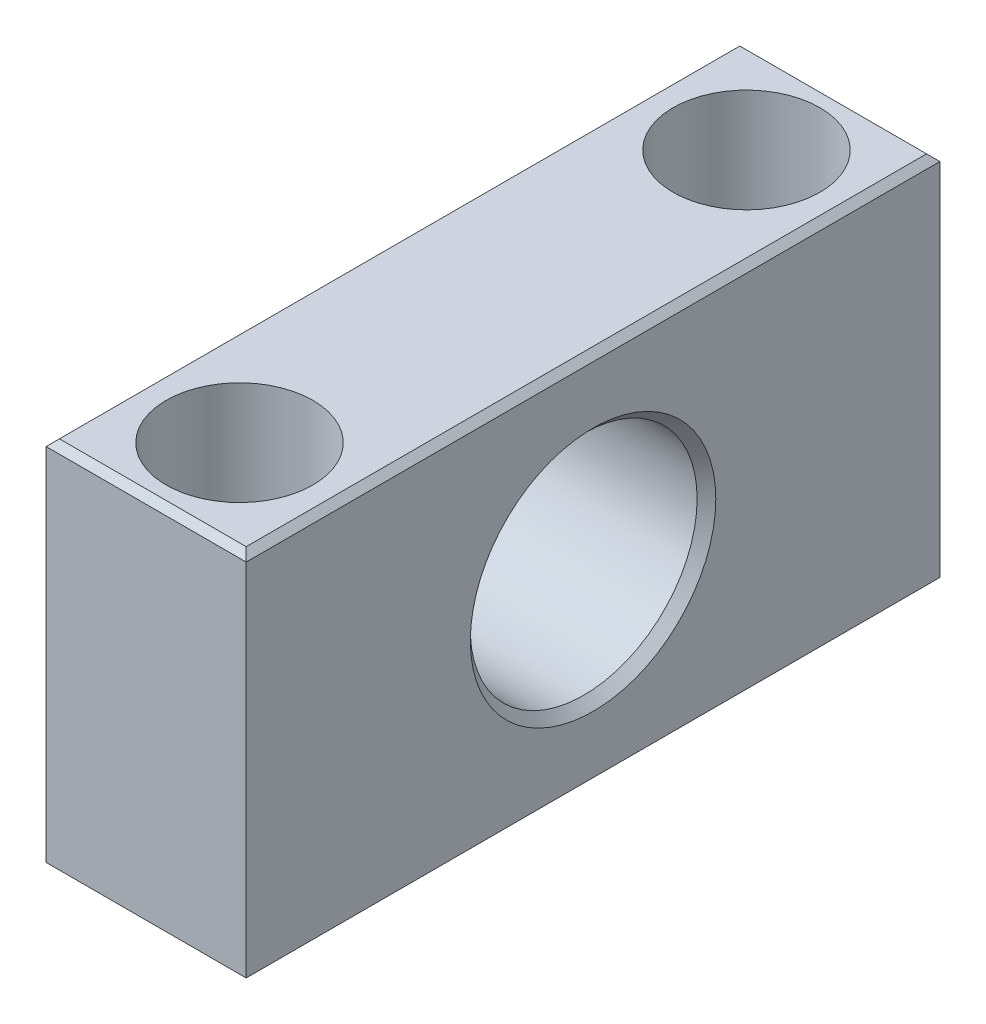
ISO-10303-21;
HEADER;
FILE_DESCRIPTION(('STEP AP214'),'2;1');
FILE_NAME('part.step','',(''),(''),'','','');
FILE_SCHEMA(('AUTOMOTIVE_DESIGN { 1 0 10303 214 1 1 1 1 }'));
ENDSEC;
DATA;
#1=APPLICATION_CONTEXT('core data for automotive mechanical design processes');
#2=APPLICATION_PROTOCOL_DEFINITION('international standard','automotive_design',2000,#1);
#3=PRODUCT_CONTEXT('',#1,'mechanical');
#4=PRODUCT('Part','Part','',(#3));
#5=PRODUCT_RELATED_PRODUCT_CATEGORY('part','',(#4));
#6=PRODUCT_DEFINITION_FORMATION('','',#4);
#7=PRODUCT_DEFINITION_CONTEXT('part definition',#1,'design');
#8=PRODUCT_DEFINITION('design','',#6,#7);
#9=PRODUCT_DEFINITION_SHAPE('','',#8);
#10=(LENGTH_UNIT() NAMED_UNIT(*) SI_UNIT(.MILLI.,.METRE.));
#11=(NAMED_UNIT(*) PLANE_ANGLE_UNIT() SI_UNIT($,.RADIAN.));
#12=(NAMED_UNIT(*) SI_UNIT($,.STERADIAN.) SOLID_ANGLE_UNIT());
#13=UNCERTAINTY_MEASURE_WITH_UNIT(LENGTH_MEASURE(1.E-05),#10,'distance_accuracy_value','');
#14=(GEOMETRIC_REPRESENTATION_CONTEXT(3) GLOBAL_UNCERTAINTY_ASSIGNED_CONTEXT((#13)) GLOBAL_UNIT_ASSIGNED_CONTEXT((#10,
#11,#12)) REPRESENTATION_CONTEXT('',''));
#15=CARTESIAN_POINT('',(0.,0.,0.));
#16=DIRECTION('',(0.,0.,1.));
#17=DIRECTION('',(1.,0.,0.));
#18=AXIS2_PLACEMENT_3D('',#15,#16,#17);
#19=CARTESIAN_POINT('',(11.9,-1.,19.));
#20=DIRECTION('',(0.,-1.,0.));
#21=DIRECTION('',(0.,0.,-1.));
#22=AXIS2_PLACEMENT_3D('',#19,#20,#21);
#23=PLANE('',#22);
#24=CARTESIAN_POINT('',(7.5,-1.,19.));
#25=DIRECTION('',(0.,-1.,0.));
#26=DIRECTION('',(0.,0.,-1.));
#27=AXIS2_PLACEMENT_3D('',#24,#25,#26);
#28=CIRCLE('',#27,3.3);
#29=CARTESIAN_POINT('',(7.5,-1.,15.7));
#30=VERTEX_POINT('',#29);
#31=EDGE_CURVE('E145',#30,#30,#28,.T.);
#32=ORIENTED_EDGE('',*,*,#31,.T.);
#33=EDGE_LOOP('',(#32));
#34=FACE_BOUND('',#33,.T.);
#35=CARTESIAN_POINT('',(7.5,-1.,19.));
#36=DIRECTION('',(0.,-1.,0.));
#37=DIRECTION('',(0.,0.,-1.));
#38=AXIS2_PLACEMENT_3D('',#35,#36,#37);
#39=CIRCLE('',#38,5.5);
#40=CARTESIAN_POINT('',(7.5,-1.,13.5));
#41=VERTEX_POINT('',#40);
#42=EDGE_CURVE('E147',#41,#41,#39,.F.);
#43=ORIENTED_EDGE('',*,*,#42,.T.);
#44=EDGE_LOOP('',(#43));
#45=FACE_BOUND('',#44,.T.);
#46=ADVANCED_FACE('F17',(#34,#45),#23,.F.);
#47=CARTESIAN_POINT('',(11.9,-1.,-19.));
#48=DIRECTION('',(0.,-1.,0.));
#49=DIRECTION('',(0.,0.,-1.));
#50=AXIS2_PLACEMENT_3D('',#47,#48,#49);
#51=PLANE('',#50);
#52=CARTESIAN_POINT('',(7.5,-1.,-19.));
#53=DIRECTION('',(0.,-1.,0.));
#54=DIRECTION('',(0.,0.,-1.));
#55=AXIS2_PLACEMENT_3D('',#52,#53,#54);
#56=CIRCLE('',#55,3.3);
#57=CARTESIAN_POINT('',(7.5,-1.,-22.3));
#58=VERTEX_POINT('',#57);
#59=EDGE_CURVE('E124',#58,#58,#56,.T.);
#60=ORIENTED_EDGE('',*,*,#59,.T.);
#61=EDGE_LOOP('',(#60));
#62=FACE_BOUND('',#61,.T.);
#63=CARTESIAN_POINT('',(7.5,-1.,-19.));
#64=DIRECTION('',(0.,-1.,0.));
#65=DIRECTION('',(0.,0.,-1.));
#66=AXIS2_PLACEMENT_3D('',#63,#64,#65);
#67=CIRCLE('',#66,5.5);
#68=CARTESIAN_POINT('',(7.5,-1.,-24.5));
#69=VERTEX_POINT('',#68);
#70=EDGE_CURVE('E20',#69,#69,#67,.F.);
#71=ORIENTED_EDGE('',*,*,#70,.T.);
#72=EDGE_LOOP('',(#71));
#73=FACE_BOUND('',#72,.T.);
#74=ADVANCED_FACE('F154',(#62,#73),#51,.F.);
#75=CARTESIAN_POINT('',(7.5,6.5,-19.));
#76=DIRECTION('',(0.,-1.,0.));
#77=DIRECTION('',(0.,0.,-1.));
#78=AXIS2_PLACEMENT_3D('',#75,#76,#77);
#79=CYLINDRICAL_SURFACE('',#78,5.5);
#80=CARTESIAN_POINT('',(7.5,14.,-19.));
#81=DIRECTION('',(0.,-1.,0.));
#82=DIRECTION('',(0.,0.,-1.));
#83=AXIS2_PLACEMENT_3D('',#80,#81,#82);
#84=CIRCLE('',#83,5.5);
#85=CARTESIAN_POINT('',(7.5,14.,-24.5));
#86=VERTEX_POINT('',#85);
#87=EDGE_CURVE('E109',#86,#86,#84,.T.);
#88=ORIENTED_EDGE('',*,*,#87,.F.);
#89=EDGE_LOOP('',(#88));
#90=FACE_BOUND('',#89,.T.);
#91=ORIENTED_EDGE('',*,*,#70,.F.);
#92=EDGE_LOOP('',(#91));
#93=FACE_BOUND('',#92,.T.);
#94=ADVANCED_FACE('F156',(#90,#93),#79,.F.);
#95=CARTESIAN_POINT('',(7.5,6.5,19.));
#96=DIRECTION('',(0.,-1.,0.));
#97=DIRECTION('',(0.,0.,-1.));
#98=AXIS2_PLACEMENT_3D('',#95,#96,#97);
#99=CYLINDRICAL_SURFACE('',#98,5.5);
#100=CARTESIAN_POINT('',(7.5,14.,19.));
#101=DIRECTION('',(0.,-1.,0.));
#102=DIRECTION('',(0.,0.,-1.));
#103=AXIS2_PLACEMENT_3D('',#100,#101,#102);
#104=CIRCLE('',#103,5.5);
#105=CARTESIAN_POINT('',(7.5,14.,13.5));
#106=VERTEX_POINT('',#105);
#107=EDGE_CURVE('E106',#106,#106,#104,.T.);
#108=ORIENTED_EDGE('',*,*,#107,.F.);
#109=EDGE_LOOP('',(#108));
#110=FACE_BOUND('',#109,.T.);
#111=ORIENTED_EDGE('',*,*,#42,.F.);
#112=EDGE_LOOP('',(#111));
#113=FACE_BOUND('',#112,.T.);
#114=ADVANCED_FACE('F158',(#110,#113),#99,.F.);
#115=CARTESIAN_POINT('',(0.,0.,0.));
#116=DIRECTION('',(-1.,0.,0.));
#117=DIRECTION('',(0.,0.,1.));
#118=AXIS2_PLACEMENT_3D('',#115,#116,#117);
#119=CONICAL_SURFACE('',#118,9.2,0.785398163397448);
#120=CARTESIAN_POINT('',(0.,0.,0.));
#121=DIRECTION('',(-1.,0.,0.));
#122=DIRECTION('',(0.,0.,1.));
#123=AXIS2_PLACEMENT_3D('',#120,#121,#122);
#124=CIRCLE('',#123,9.2);
#125=CARTESIAN_POINT('',(0.,0.,9.2));
#126=VERTEX_POINT('',#125);
#127=EDGE_CURVE('E136',#126,#126,#124,.F.);
#128=ORIENTED_EDGE('',*,*,#127,.F.);
#129=EDGE_LOOP('',(#128));
#130=FACE_BOUND('',#129,.T.);
#131=CARTESIAN_POINT('',(0.7,0.,0.));
#132=DIRECTION('',(1.,0.,0.));
#133=DIRECTION('',(0.,0.,-1.));
#134=AXIS2_PLACEMENT_3D('',#131,#132,#133);
#135=CIRCLE('',#134,8.5);
#136=CARTESIAN_POINT('',(0.7,0.,-8.5));
#137=VERTEX_POINT('',#136);
#138=EDGE_CURVE('E94',#137,#137,#135,.T.);
#139=ORIENTED_EDGE('',*,*,#138,.T.);
#140=EDGE_LOOP('',(#139));
#141=FACE_BOUND('',#140,.T.);
#142=ADVANCED_FACE('F166',(#130,#141),#119,.F.);
#143=CARTESIAN_POINT('',(0.5,14.,26.));
#144=DIRECTION('',(-0.707106781186548,0.707106781186548,0.));
#145=DIRECTION('',(-0.707106781186548,-0.707106781186548,0.));
#146=AXIS2_PLACEMENT_3D('',#143,#144,#145);
#147=PLANE('',#146);
#148=DIRECTION('',(-0.577350269189623,-0.577350269189627,-0.577350269189627));
#149=VECTOR('',#148,1.);
#150=CARTESIAN_POINT('',(0.499999999999983,14.,-25.5));
#151=LINE('',#150,#149);
#152=CARTESIAN_POINT('',(0.499999999999986,14.,-25.5));
#153=VERTEX_POINT('',#152);
#154=CARTESIAN_POINT('',(0.,13.5,-26.));
#155=VERTEX_POINT('',#154);
#156=EDGE_CURVE('E85',#153,#155,#151,.T.);
#157=ORIENTED_EDGE('',*,*,#156,.T.);
#158=DIRECTION('',(0.,0.,1.));
#159=VECTOR('',#158,1.);
#160=CARTESIAN_POINT('',(0.,13.5,26.));
#161=LINE('',#160,#159);
#162=CARTESIAN_POINT('',(0.,13.5,26.));
#163=VERTEX_POINT('',#162);
#164=EDGE_CURVE('E481',#163,#155,#161,.F.);
#165=ORIENTED_EDGE('',*,*,#164,.F.);
#166=DIRECTION('',(0.577350269189623,0.577350269189627,-0.577350269189627));
#167=VECTOR('',#166,1.);
#168=CARTESIAN_POINT('',(0.,13.5,26.));
#169=LINE('',#168,#167);
#170=CARTESIAN_POINT('',(0.49999999999999,14.,25.5));
#171=VERTEX_POINT('',#170);
#172=EDGE_CURVE('E79',#163,#171,#169,.T.);
#173=ORIENTED_EDGE('',*,*,#172,.T.);
#174=DIRECTION('',(0.,0.,1.));
#175=VECTOR('',#174,1.);
#176=CARTESIAN_POINT('',(0.499999999999995,14.,26.));
#177=LINE('',#176,#175);
#178=EDGE_CURVE('E96',#153,#171,#177,.T.);
#179=ORIENTED_EDGE('',*,*,#178,.F.);
#180=EDGE_LOOP('',(#157,#165,#173,#179));
#181=FACE_BOUND('',#180,.T.);
#182=ADVANCED_FACE('F97',(#181),#147,.T.);
#183=CARTESIAN_POINT('',(0.,-13.5,26.));
#184=DIRECTION('',(-0.707106781186548,-0.707106781186548,0.));
#185=DIRECTION('',(0.707106781186548,-0.707106781186548,0.));
#186=AXIS2_PLACEMENT_3D('',#183,#184,#185);
#187=PLANE('',#186);
#188=DIRECTION('',(0.577350269189623,-0.577350269189627,0.577350269189627));
#189=VECTOR('',#188,1.);
#190=CARTESIAN_POINT('',(0.,-13.5,-26.));
#191=LINE('',#190,#189);
#192=CARTESIAN_POINT('',(0.,-13.5,-26.));
#193=VERTEX_POINT('',#192);
#194=CARTESIAN_POINT('',(0.499999999999982,-14.,-25.5));
#195=VERTEX_POINT('',#194);
#196=EDGE_CURVE('E115',#193,#195,#191,.T.);
#197=ORIENTED_EDGE('',*,*,#196,.T.);
#198=DIRECTION('',(0.,0.,-1.));
#199=VECTOR('',#198,1.);
#200=CARTESIAN_POINT('',(0.499999999999996,-14.,26.));
#201=LINE('',#200,#199);
#202=CARTESIAN_POINT('',(0.499999999999987,-14.,25.5));
#203=VERTEX_POINT('',#202);
#204=EDGE_CURVE('E135',#203,#195,#201,.T.);
#205=ORIENTED_EDGE('',*,*,#204,.F.);
#206=DIRECTION('',(-0.577350269189623,0.577350269189627,0.577350269189627));
#207=VECTOR('',#206,1.);
#208=CARTESIAN_POINT('',(0.499999999999983,-14.,25.5));
#209=LINE('',#208,#207);
#210=CARTESIAN_POINT('',(0.,-13.5,26.));
#211=VERTEX_POINT('',#210);
#212=EDGE_CURVE('E100',#203,#211,#209,.T.);
#213=ORIENTED_EDGE('',*,*,#212,.T.);
#214=DIRECTION('',(0.,0.,1.));
#215=VECTOR('',#214,1.);
#216=CARTESIAN_POINT('',(0.,-13.5,26.));
#217=LINE('',#216,#215);
#218=EDGE_CURVE('E138',#193,#211,#217,.T.);
#219=ORIENTED_EDGE('',*,*,#218,.F.);
#220=EDGE_LOOP('',(#197,#205,#213,#219));
#221=FACE_BOUND('',#220,.T.);
#222=ADVANCED_FACE('F234',(#221),#187,.T.);
#223=CARTESIAN_POINT('',(7.5,-7.5,19.));
#224=DIRECTION('',(0.,-1.,0.));
#225=DIRECTION('',(0.,0.,-1.));
#226=AXIS2_PLACEMENT_3D('',#223,#224,#225);
#227=CYLINDRICAL_SURFACE('',#226,3.3);
#228=CARTESIAN_POINT('',(7.5,-14.,19.));
#229=DIRECTION('',(0.,-1.,0.));
#230=DIRECTION('',(0.,0.,-1.));
#231=AXIS2_PLACEMENT_3D('',#228,#229,#230);
#232=CIRCLE('',#231,3.3);
#233=CARTESIAN_POINT('',(7.5,-14.,15.7));
#234=VERTEX_POINT('',#233);
#235=EDGE_CURVE('E132',#234,#234,#232,.F.);
#236=ORIENTED_EDGE('',*,*,#235,.F.);
#237=EDGE_LOOP('',(#236));
#238=FACE_BOUND('',#237,.T.);
#239=ORIENTED_EDGE('',*,*,#31,.F.);
#240=EDGE_LOOP('',(#239));
#241=FACE_BOUND('',#240,.T.);
#242=ADVANCED_FACE('F230',(#238,#241),#227,.F.);
#243=CARTESIAN_POINT('',(7.5,-7.5,-19.));
#244=DIRECTION('',(0.,-1.,0.));
#245=DIRECTION('',(0.,0.,-1.));
#246=AXIS2_PLACEMENT_3D('',#243,#244,#245);
#247=CYLINDRICAL_SURFACE('',#246,3.3);
#248=CARTESIAN_POINT('',(7.5,-14.,-19.));
#249=DIRECTION('',(0.,-1.,0.));
#250=DIRECTION('',(0.,0.,-1.));
#251=AXIS2_PLACEMENT_3D('',#248,#249,#250);
#252=CIRCLE('',#251,3.3);
#253=CARTESIAN_POINT('',(7.5,-14.,-22.3));
#254=VERTEX_POINT('',#253);
#255=EDGE_CURVE('E121',#254,#254,#252,.F.);
#256=ORIENTED_EDGE('',*,*,#255,.F.);
#257=EDGE_LOOP('',(#256));
#258=FACE_BOUND('',#257,.T.);
#259=ORIENTED_EDGE('',*,*,#59,.F.);
#260=EDGE_LOOP('',(#259));
#261=FACE_BOUND('',#260,.T.);
#262=ADVANCED_FACE('F226',(#258,#261),#247,.F.);
#263=CARTESIAN_POINT('',(7.5,0.,0.));
#264=DIRECTION('',(1.,0.,0.));
#265=DIRECTION('',(0.,0.,-1.));
#266=AXIS2_PLACEMENT_3D('',#263,#264,#265);
#267=CYLINDRICAL_SURFACE('',#266,8.5);
#268=CARTESIAN_POINT('',(14.3,0.,0.));
#269=DIRECTION('',(1.,0.,0.));
#270=DIRECTION('',(0.,1.,0.));
#271=AXIS2_PLACEMENT_3D('',#268,#269,#270);
#272=CIRCLE('',#271,8.5);
#273=CARTESIAN_POINT('',(14.3,8.5,0.));
#274=VERTEX_POINT('',#273);
#275=EDGE_CURVE('E118',#274,#274,#272,.T.);
#276=ORIENTED_EDGE('',*,*,#275,.T.);
#277=EDGE_LOOP('',(#276));
#278=FACE_BOUND('',#277,.T.);
#279=ORIENTED_EDGE('',*,*,#138,.F.);
#280=EDGE_LOOP('',(#279));
#281=FACE_BOUND('',#280,.T.);
#282=ADVANCED_FACE('F223',(#278,#281),#267,.F.);
#283=CARTESIAN_POINT('',(26.,14.,-25.5));
#284=DIRECTION('',(0.,-0.707106781186548,0.707106781186548));
#285=DIRECTION('',(0.,-0.707106781186548,-0.707106781186548));
#286=AXIS2_PLACEMENT_3D('',#283,#284,#285);
#287=PLANE('',#286);
#288=DIRECTION('',(1.,0.,0.));
#289=VECTOR('',#288,1.);
#290=CARTESIAN_POINT('',(0.,13.5,-26.));
#291=LINE('',#290,#289);
#292=CARTESIAN_POINT('',(15.,13.5,-26.));
#293=VERTEX_POINT('',#292);
#294=EDGE_CURVE('E91',#293,#155,#291,.F.);
#295=ORIENTED_EDGE('',*,*,#294,.T.);
#296=ORIENTED_EDGE('',*,*,#156,.F.);
#297=DIRECTION('',(1.,0.,0.));
#298=VECTOR('',#297,1.);
#299=CARTESIAN_POINT('',(14.5,14.,-25.5));
#300=LINE('',#299,#298);
#301=CARTESIAN_POINT('',(14.5,14.,-25.5));
#302=VERTEX_POINT('',#301);
#303=EDGE_CURVE('E88',#302,#153,#300,.F.);
#304=ORIENTED_EDGE('',*,*,#303,.F.);
#305=DIRECTION('',(-0.577350269189624,0.577350269189626,0.577350269189626));
#306=VECTOR('',#305,1.);
#307=CARTESIAN_POINT('',(15.,13.5,-26.));
#308=LINE('',#307,#306);
#309=EDGE_CURVE('E93',#293,#302,#308,.T.);
#310=ORIENTED_EDGE('',*,*,#309,.F.);
#311=EDGE_LOOP('',(#295,#296,#304,#310));
#312=FACE_BOUND('',#311,.T.);
#313=ADVANCED_FACE('F86',(#312),#287,.F.);
#314=CARTESIAN_POINT('',(26.,-13.5,-26.));
#315=DIRECTION('',(0.,0.707106781186548,0.707106781186548));
#316=DIRECTION('',(0.,-0.707106781186548,0.707106781186548));
#317=AXIS2_PLACEMENT_3D('',#314,#315,#316);
#318=PLANE('',#317);
#319=DIRECTION('',(1.,0.,0.));
#320=VECTOR('',#319,1.);
#321=CARTESIAN_POINT('',(0.5,-14.,-25.5));
#322=LINE('',#321,#320);
#323=CARTESIAN_POINT('',(14.5,-14.,-25.5));
#324=VERTEX_POINT('',#323);
#325=EDGE_CURVE('E476',#195,#324,#322,.T.);
#326=ORIENTED_EDGE('',*,*,#325,.F.);
#327=ORIENTED_EDGE('',*,*,#196,.F.);
#328=DIRECTION('',(1.,0.,0.));
#329=VECTOR('',#328,1.);
#330=CARTESIAN_POINT('',(0.,-13.5,-26.));
#331=LINE('',#330,#329);
#332=CARTESIAN_POINT('',(15.,-13.5,-26.));
#333=VERTEX_POINT('',#332);
#334=EDGE_CURVE('E512',#193,#333,#331,.T.);
#335=ORIENTED_EDGE('',*,*,#334,.T.);
#336=DIRECTION('',(0.577350269189624,0.577350269189626,-0.577350269189626));
#337=VECTOR('',#336,1.);
#338=CARTESIAN_POINT('',(14.5,-14.,-25.5));
#339=LINE('',#338,#337);
#340=EDGE_CURVE('E113',#324,#333,#339,.T.);
#341=ORIENTED_EDGE('',*,*,#340,.F.);
#342=EDGE_LOOP('',(#326,#327,#335,#341));
#343=FACE_BOUND('',#342,.T.);
#344=ADVANCED_FACE('F217',(#343),#318,.F.);
#345=CARTESIAN_POINT('',(14.5,14.,26.));
#346=DIRECTION('',(0.,1.,0.));
#347=DIRECTION('',(0.,0.,1.));
#348=AXIS2_PLACEMENT_3D('',#345,#346,#347);
#349=PLANE('',#348);
#350=DIRECTION('',(1.,0.,0.));
#351=VECTOR('',#350,1.);
#352=CARTESIAN_POINT('',(26.,14.,25.5));
#353=LINE('',#352,#351);
#354=CARTESIAN_POINT('',(14.5,14.,25.5));
#355=VERTEX_POINT('',#354);
#356=EDGE_CURVE('E139',#171,#355,#353,.T.);
#357=ORIENTED_EDGE('',*,*,#356,.T.);
#358=DIRECTION('',(0.,0.,1.));
#359=VECTOR('',#358,1.);
#360=CARTESIAN_POINT('',(14.5,14.,26.));
#361=LINE('',#360,#359);
#362=EDGE_CURVE('E105',#302,#355,#361,.T.);
#363=ORIENTED_EDGE('',*,*,#362,.F.);
#364=ORIENTED_EDGE('',*,*,#303,.T.);
#365=ORIENTED_EDGE('',*,*,#178,.T.);
#366=EDGE_LOOP('',(#357,#363,#364,#365));
#367=FACE_BOUND('',#366,.T.);
#368=ORIENTED_EDGE('',*,*,#107,.T.);
#369=EDGE_LOOP('',(#368));
#370=FACE_BOUND('',#369,.T.);
#371=ORIENTED_EDGE('',*,*,#87,.T.);
#372=EDGE_LOOP('',(#371));
#373=FACE_BOUND('',#372,.T.);
#374=ADVANCED_FACE('F102',(#367,#370,#373),#349,.T.);
#375=CARTESIAN_POINT('',(26.,-14.,25.5));
#376=DIRECTION('',(0.,0.707106781186548,-0.707106781186548));
#377=DIRECTION('',(0.,0.707106781186548,0.707106781186548));
#378=AXIS2_PLACEMENT_3D('',#375,#376,#377);
#379=PLANE('',#378);
#380=DIRECTION('',(1.,0.,0.));
#381=VECTOR('',#380,1.);
#382=CARTESIAN_POINT('',(0.,-13.5,26.));
#383=LINE('',#382,#381);
#384=CARTESIAN_POINT('',(15.,-13.5,26.));
#385=VERTEX_POINT('',#384);
#386=EDGE_CURVE('E492',#211,#385,#383,.T.);
#387=ORIENTED_EDGE('',*,*,#386,.F.);
#388=ORIENTED_EDGE('',*,*,#212,.F.);
#389=DIRECTION('',(1.,0.,0.));
#390=VECTOR('',#389,1.);
#391=CARTESIAN_POINT('',(0.5,-14.,25.5));
#392=LINE('',#391,#390);
#393=CARTESIAN_POINT('',(14.5,-14.,25.5));
#394=VERTEX_POINT('',#393);
#395=EDGE_CURVE('E480',#394,#203,#392,.F.);
#396=ORIENTED_EDGE('',*,*,#395,.F.);
#397=DIRECTION('',(-0.577350269189624,-0.577350269189626,-0.577350269189626));
#398=VECTOR('',#397,1.);
#399=CARTESIAN_POINT('',(15.,-13.5,26.));
#400=LINE('',#399,#398);
#401=EDGE_CURVE('E35',#385,#394,#400,.T.);
#402=ORIENTED_EDGE('',*,*,#401,.F.);
#403=EDGE_LOOP('',(#387,#388,#396,#402));
#404=FACE_BOUND('',#403,.T.);
#405=ADVANCED_FACE('F211',(#404),#379,.F.);
#406=CARTESIAN_POINT('',(26.,13.5,26.));
#407=DIRECTION('',(0.,-0.707106781186548,-0.707106781186548));
#408=DIRECTION('',(0.,0.707106781186548,-0.707106781186548));
#409=AXIS2_PLACEMENT_3D('',#406,#407,#408);
#410=PLANE('',#409);
#411=ORIENTED_EDGE('',*,*,#356,.F.);
#412=ORIENTED_EDGE('',*,*,#172,.F.);
#413=DIRECTION('',(1.,0.,0.));
#414=VECTOR('',#413,1.);
#415=CARTESIAN_POINT('',(0.,13.5,26.));
#416=LINE('',#415,#414);
#417=CARTESIAN_POINT('',(15.,13.5,26.));
#418=VERTEX_POINT('',#417);
#419=EDGE_CURVE('E496',#418,#163,#416,.F.);
#420=ORIENTED_EDGE('',*,*,#419,.F.);
#421=DIRECTION('',(0.577350269189626,-0.577350269189626,0.577350269189626));
#422=VECTOR('',#421,1.);
#423=CARTESIAN_POINT('',(14.5,14.,25.5));
#424=LINE('',#423,#422);
#425=EDGE_CURVE('E497',#355,#418,#424,.T.);
#426=ORIENTED_EDGE('',*,*,#425,.F.);
#427=EDGE_LOOP('',(#411,#412,#420,#426));
#428=FACE_BOUND('',#427,.T.);
#429=ADVANCED_FACE('F207',(#428),#410,.F.);
#430=CARTESIAN_POINT('',(0.,13.5,26.));
#431=DIRECTION('',(-1.,0.,0.));
#432=DIRECTION('',(0.,0.,1.));
#433=AXIS2_PLACEMENT_3D('',#430,#431,#432);
#434=PLANE('',#433);
#435=DIRECTION('',(0.,1.,0.));
#436=VECTOR('',#435,1.);
#437=CARTESIAN_POINT('',(0.,0.,26.));
#438=LINE('',#437,#436);
#439=EDGE_CURVE('E500',#163,#211,#438,.F.);
#440=ORIENTED_EDGE('',*,*,#439,.F.);
#441=ORIENTED_EDGE('',*,*,#164,.T.);
#442=DIRECTION('',(0.,1.,0.));
#443=VECTOR('',#442,1.);
#444=CARTESIAN_POINT('',(0.,0.,-26.));
#445=LINE('',#444,#443);
#446=EDGE_CURVE('E503',#155,#193,#445,.F.);
#447=ORIENTED_EDGE('',*,*,#446,.T.);
#448=ORIENTED_EDGE('',*,*,#218,.T.);
#449=EDGE_LOOP('',(#440,#441,#447,#448));
#450=FACE_BOUND('',#449,.T.);
#451=ORIENTED_EDGE('',*,*,#127,.T.);
#452=EDGE_LOOP('',(#451));
#453=FACE_BOUND('',#452,.T.);
#454=ADVANCED_FACE('F203',(#450,#453),#434,.T.);
#455=CARTESIAN_POINT('',(0.5,-14.,26.));
#456=DIRECTION('',(0.,-1.,0.));
#457=DIRECTION('',(0.,0.,-1.));
#458=AXIS2_PLACEMENT_3D('',#455,#456,#457);
#459=PLANE('',#458);
#460=ORIENTED_EDGE('',*,*,#255,.T.);
#461=EDGE_LOOP('',(#460));
#462=FACE_BOUND('',#461,.T.);
#463=ORIENTED_EDGE('',*,*,#235,.T.);
#464=EDGE_LOOP('',(#463));
#465=FACE_BOUND('',#464,.T.);
#466=ORIENTED_EDGE('',*,*,#395,.T.);
#467=ORIENTED_EDGE('',*,*,#204,.T.);
#468=ORIENTED_EDGE('',*,*,#325,.T.);
#469=DIRECTION('',(0.,0.,1.));
#470=VECTOR('',#469,1.);
#471=CARTESIAN_POINT('',(14.5,-14.,26.));
#472=LINE('',#471,#470);
#473=EDGE_CURVE('E129',#394,#324,#472,.F.);
#474=ORIENTED_EDGE('',*,*,#473,.F.);
#475=EDGE_LOOP('',(#466,#467,#468,#474));
#476=FACE_BOUND('',#475,.T.);
#477=ADVANCED_FACE('F199',(#462,#465,#476),#459,.T.);
#478=CARTESIAN_POINT('',(15.,0.,0.));
#479=DIRECTION('',(1.,0.,0.));
#480=DIRECTION('',(0.,0.,-1.));
#481=AXIS2_PLACEMENT_3D('',#478,#479,#480);
#482=CONICAL_SURFACE('',#481,9.2,0.785398163397448);
#483=CARTESIAN_POINT('',(15.,0.,0.));
#484=DIRECTION('',(1.,0.,0.));
#485=DIRECTION('',(0.,0.,-1.));
#486=AXIS2_PLACEMENT_3D('',#483,#484,#485);
#487=CIRCLE('',#486,9.2);
#488=CARTESIAN_POINT('',(15.,0.,-9.2));
#489=VERTEX_POINT('',#488);
#490=EDGE_CURVE('E125',#489,#489,#487,.F.);
#491=ORIENTED_EDGE('',*,*,#490,.F.);
#492=EDGE_LOOP('',(#491));
#493=FACE_BOUND('',#492,.T.);
#494=ORIENTED_EDGE('',*,*,#275,.F.);
#495=EDGE_LOOP('',(#494));
#496=FACE_BOUND('',#495,.T.);
#497=ADVANCED_FACE('F195',(#493,#496),#482,.F.);
#498=CARTESIAN_POINT('',(0.,0.,-26.));
#499=DIRECTION('',(0.,0.,1.));
#500=DIRECTION('',(1.,0.,0.));
#501=AXIS2_PLACEMENT_3D('',#498,#499,#500);
#502=PLANE('',#501);
#503=ORIENTED_EDGE('',*,*,#446,.F.);
#504=ORIENTED_EDGE('',*,*,#294,.F.);
#505=DIRECTION('',(0.,1.,0.));
#506=VECTOR('',#505,1.);
#507=CARTESIAN_POINT('',(15.,-13.5,-26.));
#508=LINE('',#507,#506);
#509=EDGE_CURVE('E128',#333,#293,#508,.T.);
#510=ORIENTED_EDGE('',*,*,#509,.F.);
#511=ORIENTED_EDGE('',*,*,#334,.F.);
#512=EDGE_LOOP('',(#503,#504,#510,#511));
#513=FACE_BOUND('',#512,.T.);
#514=ADVANCED_FACE('F191',(#513),#502,.F.);
#515=CARTESIAN_POINT('',(15.,13.5,26.));
#516=DIRECTION('',(0.707106781186548,0.707106781186548,0.));
#517=DIRECTION('',(-0.707106781186548,0.707106781186548,0.));
#518=AXIS2_PLACEMENT_3D('',#515,#516,#517);
#519=PLANE('',#518);
#520=ORIENTED_EDGE('',*,*,#425,.T.);
#521=DIRECTION('',(0.,0.,-1.));
#522=VECTOR('',#521,1.);
#523=CARTESIAN_POINT('',(15.,13.5,26.));
#524=LINE('',#523,#522);
#525=EDGE_CURVE('E517',#293,#418,#524,.F.);
#526=ORIENTED_EDGE('',*,*,#525,.F.);
#527=ORIENTED_EDGE('',*,*,#309,.T.);
#528=ORIENTED_EDGE('',*,*,#362,.T.);
#529=EDGE_LOOP('',(#520,#526,#527,#528));
#530=FACE_BOUND('',#529,.T.);
#531=ADVANCED_FACE('F187',(#530),#519,.T.);
#532=CARTESIAN_POINT('',(0.,0.,26.));
#533=DIRECTION('',(0.,0.,1.));
#534=DIRECTION('',(1.,0.,0.));
#535=AXIS2_PLACEMENT_3D('',#532,#533,#534);
#536=PLANE('',#535);
#537=ORIENTED_EDGE('',*,*,#419,.T.);
#538=ORIENTED_EDGE('',*,*,#439,.T.);
#539=ORIENTED_EDGE('',*,*,#386,.T.);
#540=DIRECTION('',(0.,1.,0.));
#541=VECTOR('',#540,1.);
#542=CARTESIAN_POINT('',(15.,-13.5,26.));
#543=LINE('',#542,#541);
#544=EDGE_CURVE('E26',#418,#385,#543,.F.);
#545=ORIENTED_EDGE('',*,*,#544,.F.);
#546=EDGE_LOOP('',(#537,#538,#539,#545));
#547=FACE_BOUND('',#546,.T.);
#548=ADVANCED_FACE('F179',(#547),#536,.T.);
#549=CARTESIAN_POINT('',(14.5,-14.,26.));
#550=DIRECTION('',(0.707106781186548,-0.707106781186548,0.));
#551=DIRECTION('',(0.707106781186548,0.707106781186548,0.));
#552=AXIS2_PLACEMENT_3D('',#549,#550,#551);
#553=PLANE('',#552);
#554=ORIENTED_EDGE('',*,*,#401,.T.);
#555=ORIENTED_EDGE('',*,*,#473,.T.);
#556=ORIENTED_EDGE('',*,*,#340,.T.);
#557=DIRECTION('',(0.,0.,-1.));
#558=VECTOR('',#557,1.);
#559=CARTESIAN_POINT('',(15.,-13.5,26.));
#560=LINE('',#559,#558);
#561=EDGE_CURVE('E11',#385,#333,#560,.T.);
#562=ORIENTED_EDGE('',*,*,#561,.F.);
#563=EDGE_LOOP('',(#554,#555,#556,#562));
#564=FACE_BOUND('',#563,.T.);
#565=ADVANCED_FACE('F173',(#564),#553,.T.);
#566=CARTESIAN_POINT('',(15.,-13.5,26.));
#567=DIRECTION('',(1.,0.,0.));
#568=DIRECTION('',(0.,0.,-1.));
#569=AXIS2_PLACEMENT_3D('',#566,#567,#568);
#570=PLANE('',#569);
#571=ORIENTED_EDGE('',*,*,#544,.T.);
#572=ORIENTED_EDGE('',*,*,#561,.T.);
#573=ORIENTED_EDGE('',*,*,#509,.T.);
#574=ORIENTED_EDGE('',*,*,#525,.T.);
#575=EDGE_LOOP('',(#571,#572,#573,#574));
#576=FACE_BOUND('',#575,.T.);
#577=ORIENTED_EDGE('',*,*,#490,.T.);
#578=EDGE_LOOP('',(#577));
#579=FACE_BOUND('',#578,.T.);
#580=ADVANCED_FACE('F171',(#576,#579),#570,.T.);
#581=CLOSED_SHELL('',(#46,#74,#94,#114,#142,#182,#222,#242,#262,#282,#313,#344,#374,#405,#429,
#454,#477,#497,#514,#531,#548,#565,#580));
#582=MANIFOLD_SOLID_BREP('B1',#581);
#583=ADVANCED_BREP_SHAPE_REPRESENTATION('',(#18,#582),#14);
#584=SHAPE_DEFINITION_REPRESENTATION(#9,#583);
ENDSEC;
END-ISO-10303-21;
